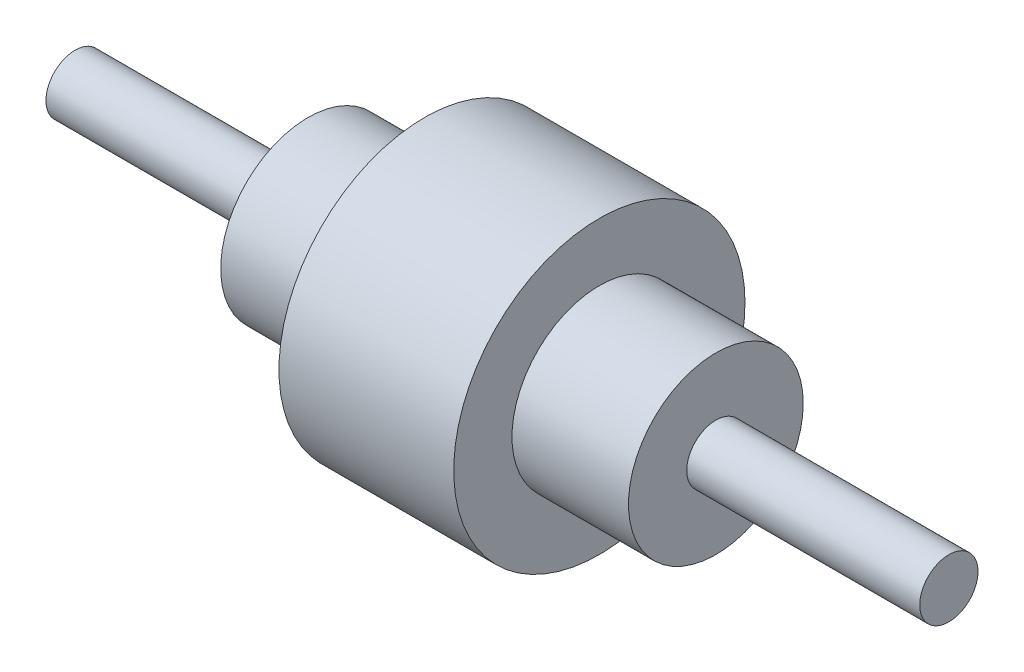
ISO-10303-21;
HEADER;
FILE_DESCRIPTION(('STEP AP214'),'2;1');
FILE_NAME('part.step','',(''),(''),'','','');
FILE_SCHEMA(('AUTOMOTIVE_DESIGN { 1 0 10303 214 1 1 1 1 }'));
ENDSEC;
DATA;
#1=APPLICATION_CONTEXT('core data for automotive mechanical design processes');
#2=APPLICATION_PROTOCOL_DEFINITION('international standard','automotive_design',2000,#1);
#3=PRODUCT_CONTEXT('',#1,'mechanical');
#4=PRODUCT('Part','Part','',(#3));
#5=PRODUCT_RELATED_PRODUCT_CATEGORY('part','',(#4));
#6=PRODUCT_DEFINITION_FORMATION('','',#4);
#7=PRODUCT_DEFINITION_CONTEXT('part definition',#1,'design');
#8=PRODUCT_DEFINITION('design','',#6,#7);
#9=PRODUCT_DEFINITION_SHAPE('','',#8);
#10=(LENGTH_UNIT() NAMED_UNIT(*) SI_UNIT(.MILLI.,.METRE.));
#11=(NAMED_UNIT(*) PLANE_ANGLE_UNIT() SI_UNIT($,.RADIAN.));
#12=(NAMED_UNIT(*) SI_UNIT($,.STERADIAN.) SOLID_ANGLE_UNIT());
#13=UNCERTAINTY_MEASURE_WITH_UNIT(LENGTH_MEASURE(1.E-05),#10,'distance_accuracy_value','');
#14=(GEOMETRIC_REPRESENTATION_CONTEXT(3) GLOBAL_UNCERTAINTY_ASSIGNED_CONTEXT((#13)) GLOBAL_UNIT_ASSIGNED_CONTEXT((#10,
#11,#12)) REPRESENTATION_CONTEXT('',''));
#15=CARTESIAN_POINT('',(0.,0.,0.));
#16=DIRECTION('',(0.,0.,1.));
#17=DIRECTION('',(1.,0.,0.));
#18=AXIS2_PLACEMENT_3D('',#15,#16,#17);
#19=CARTESIAN_POINT('',(105.011364726982,0.,50.));
#20=DIRECTION('',(-1.,0.,0.));
#21=DIRECTION('',(0.,0.,1.));
#22=AXIS2_PLACEMENT_3D('',#19,#20,#21);
#23=PLANE('',#22);
#24=CARTESIAN_POINT('',(105.011364726982,0.,0.));
#25=DIRECTION('',(1.,0.,0.));
#26=DIRECTION('',(0.,0.,-1.));
#27=AXIS2_PLACEMENT_3D('',#24,#25,#26);
#28=CIRCLE('',#27,30.);
#29=CARTESIAN_POINT('',(105.011364726982,0.,-30.));
#30=VERTEX_POINT('',#29);
#31=EDGE_CURVE('E65',#30,#30,#28,.T.);
#32=ORIENTED_EDGE('',*,*,#31,.F.);
#33=EDGE_LOOP('',(#32));
#34=FACE_BOUND('',#33,.T.);
#35=CARTESIAN_POINT('',(105.011364726982,0.,0.));
#36=DIRECTION('',(1.,0.,0.));
#37=DIRECTION('',(0.,0.,-1.));
#38=AXIS2_PLACEMENT_3D('',#35,#36,#37);
#39=CIRCLE('',#38,50.);
#40=CARTESIAN_POINT('',(105.011364726982,0.,-50.));
#41=VERTEX_POINT('',#40);
#42=EDGE_CURVE('E10',#41,#41,#39,.T.);
#43=ORIENTED_EDGE('',*,*,#42,.T.);
#44=EDGE_LOOP('',(#43));
#45=FACE_BOUND('',#44,.T.);
#46=ADVANCED_FACE('F31',(#34,#45),#23,.F.);
#47=CARTESIAN_POINT('',(0.,0.,0.));
#48=DIRECTION('',(1.,0.,0.));
#49=DIRECTION('',(0.,0.,-1.));
#50=AXIS2_PLACEMENT_3D('',#47,#48,#49);
#51=CYLINDRICAL_SURFACE('',#50,50.);
#52=ORIENTED_EDGE('',*,*,#42,.F.);
#53=EDGE_LOOP('',(#52));
#54=FACE_BOUND('',#53,.T.);
#55=CARTESIAN_POINT('',(45.0113647269819,0.,0.));
#56=DIRECTION('',(1.,0.,0.));
#57=DIRECTION('',(0.,0.,-1.));
#58=AXIS2_PLACEMENT_3D('',#55,#56,#57);
#59=CIRCLE('',#58,50.);
#60=CARTESIAN_POINT('',(45.0113647269819,0.,-50.));
#61=VERTEX_POINT('',#60);
#62=EDGE_CURVE('E37',#61,#61,#59,.T.);
#63=ORIENTED_EDGE('',*,*,#62,.T.);
#64=EDGE_LOOP('',(#63));
#65=FACE_BOUND('',#64,.T.);
#66=ADVANCED_FACE('F72',(#54,#65),#51,.T.);
#67=CARTESIAN_POINT('',(45.0113647269819,0.,30.));
#68=DIRECTION('',(1.,0.,0.));
#69=DIRECTION('',(0.,0.,-1.));
#70=AXIS2_PLACEMENT_3D('',#67,#68,#69);
#71=PLANE('',#70);
#72=ORIENTED_EDGE('',*,*,#62,.F.);
#73=EDGE_LOOP('',(#72));
#74=FACE_BOUND('',#73,.T.);
#75=CARTESIAN_POINT('',(45.0113647269819,0.,0.));
#76=DIRECTION('',(1.,0.,0.));
#77=DIRECTION('',(0.,0.,-1.));
#78=AXIS2_PLACEMENT_3D('',#75,#76,#77);
#79=CIRCLE('',#78,30.);
#80=CARTESIAN_POINT('',(45.0113647269819,0.,-30.));
#81=VERTEX_POINT('',#80);
#82=EDGE_CURVE('E41',#81,#81,#79,.T.);
#83=ORIENTED_EDGE('',*,*,#82,.T.);
#84=EDGE_LOOP('',(#83));
#85=FACE_BOUND('',#84,.T.);
#86=ADVANCED_FACE('F76',(#74,#85),#71,.F.);
#87=CARTESIAN_POINT('',(0.,0.,0.));
#88=DIRECTION('',(1.,0.,0.));
#89=DIRECTION('',(0.,0.,-1.));
#90=AXIS2_PLACEMENT_3D('',#87,#88,#89);
#91=CYLINDRICAL_SURFACE('',#90,30.);
#92=ORIENTED_EDGE('',*,*,#82,.F.);
#93=EDGE_LOOP('',(#92));
#94=FACE_BOUND('',#93,.T.);
#95=CARTESIAN_POINT('',(5.0113647269819,0.,0.));
#96=DIRECTION('',(1.,0.,0.));
#97=DIRECTION('',(0.,0.,-1.));
#98=AXIS2_PLACEMENT_3D('',#95,#96,#97);
#99=CIRCLE('',#98,30.);
#100=CARTESIAN_POINT('',(5.0113647269819,0.,-30.));
#101=VERTEX_POINT('',#100);
#102=EDGE_CURVE('E45',#101,#101,#99,.T.);
#103=ORIENTED_EDGE('',*,*,#102,.T.);
#104=EDGE_LOOP('',(#103));
#105=FACE_BOUND('',#104,.T.);
#106=ADVANCED_FACE('F81',(#94,#105),#91,.T.);
#107=CARTESIAN_POINT('',(5.0113647269819,0.,30.));
#108=DIRECTION('',(1.,0.,0.));
#109=DIRECTION('',(0.,0.,-1.));
#110=AXIS2_PLACEMENT_3D('',#107,#108,#109);
#111=PLANE('',#110);
#112=ORIENTED_EDGE('',*,*,#102,.F.);
#113=EDGE_LOOP('',(#112));
#114=FACE_BOUND('',#113,.T.);
#115=CARTESIAN_POINT('',(5.0113647269819,0.,0.));
#116=DIRECTION('',(1.,0.,0.));
#117=DIRECTION('',(0.,0.,-1.));
#118=AXIS2_PLACEMENT_3D('',#115,#116,#117);
#119=CIRCLE('',#118,10.);
#120=CARTESIAN_POINT('',(5.0113647269819,0.,-10.));
#121=VERTEX_POINT('',#120);
#122=EDGE_CURVE('E50',#121,#121,#119,.T.);
#123=ORIENTED_EDGE('',*,*,#122,.T.);
#124=EDGE_LOOP('',(#123));
#125=FACE_BOUND('',#124,.T.);
#126=ADVANCED_FACE('F87',(#114,#125),#111,.F.);
#127=CARTESIAN_POINT('',(0.,0.,0.));
#128=DIRECTION('',(1.,0.,0.));
#129=DIRECTION('',(0.,0.,-1.));
#130=AXIS2_PLACEMENT_3D('',#127,#128,#129);
#131=CYLINDRICAL_SURFACE('',#130,10.);
#132=ORIENTED_EDGE('',*,*,#122,.F.);
#133=EDGE_LOOP('',(#132));
#134=FACE_BOUND('',#133,.T.);
#135=CARTESIAN_POINT('',(-74.9886352730181,0.,0.));
#136=DIRECTION('',(1.,0.,0.));
#137=DIRECTION('',(0.,0.,-1.));
#138=AXIS2_PLACEMENT_3D('',#135,#136,#137);
#139=CIRCLE('',#138,10.);
#140=CARTESIAN_POINT('',(-74.9886352730181,0.,-10.));
#141=VERTEX_POINT('',#140);
#142=EDGE_CURVE('E53',#141,#141,#139,.T.);
#143=ORIENTED_EDGE('',*,*,#142,.T.);
#144=EDGE_LOOP('',(#143));
#145=FACE_BOUND('',#144,.T.);
#146=ADVANCED_FACE('F91',(#134,#145),#131,.T.);
#147=CARTESIAN_POINT('',(-74.9886352730181,0.,10.));
#148=DIRECTION('',(1.,0.,0.));
#149=DIRECTION('',(0.,0.,-1.));
#150=AXIS2_PLACEMENT_3D('',#147,#148,#149);
#151=PLANE('',#150);
#152=ORIENTED_EDGE('',*,*,#142,.F.);
#153=EDGE_LOOP('',(#152));
#154=FACE_BOUND('',#153,.T.);
#155=ADVANCED_FACE('F95',(#154),#151,.F.);
#156=CARTESIAN_POINT('',(225.011364726982,0.,10.));
#157=DIRECTION('',(-1.,0.,0.));
#158=DIRECTION('',(0.,0.,1.));
#159=AXIS2_PLACEMENT_3D('',#156,#157,#158);
#160=PLANE('',#159);
#161=CARTESIAN_POINT('',(225.011364726982,0.,0.));
#162=DIRECTION('',(1.,0.,0.));
#163=DIRECTION('',(0.,0.,-1.));
#164=AXIS2_PLACEMENT_3D('',#161,#162,#163);
#165=CIRCLE('',#164,10.);
#166=CARTESIAN_POINT('',(225.011364726982,0.,-10.));
#167=VERTEX_POINT('',#166);
#168=EDGE_CURVE('E56',#167,#167,#165,.T.);
#169=ORIENTED_EDGE('',*,*,#168,.T.);
#170=EDGE_LOOP('',(#169));
#171=FACE_BOUND('',#170,.T.);
#172=ADVANCED_FACE('F99',(#171),#160,.F.);
#173=CARTESIAN_POINT('',(0.,0.,0.));
#174=DIRECTION('',(1.,0.,0.));
#175=DIRECTION('',(0.,0.,-1.));
#176=AXIS2_PLACEMENT_3D('',#173,#174,#175);
#177=CYLINDRICAL_SURFACE('',#176,10.);
#178=ORIENTED_EDGE('',*,*,#168,.F.);
#179=EDGE_LOOP('',(#178));
#180=FACE_BOUND('',#179,.T.);
#181=CARTESIAN_POINT('',(145.011364726982,0.,0.));
#182=DIRECTION('',(1.,0.,0.));
#183=DIRECTION('',(0.,0.,-1.));
#184=AXIS2_PLACEMENT_3D('',#181,#182,#183);
#185=CIRCLE('',#184,10.);
#186=CARTESIAN_POINT('',(145.011364726982,0.,-10.));
#187=VERTEX_POINT('',#186);
#188=EDGE_CURVE('E59',#187,#187,#185,.T.);
#189=ORIENTED_EDGE('',*,*,#188,.T.);
#190=EDGE_LOOP('',(#189));
#191=FACE_BOUND('',#190,.T.);
#192=ADVANCED_FACE('F103',(#180,#191),#177,.T.);
#193=CARTESIAN_POINT('',(145.011364726982,0.,30.));
#194=DIRECTION('',(-1.,0.,0.));
#195=DIRECTION('',(0.,0.,1.));
#196=AXIS2_PLACEMENT_3D('',#193,#194,#195);
#197=PLANE('',#196);
#198=ORIENTED_EDGE('',*,*,#188,.F.);
#199=EDGE_LOOP('',(#198));
#200=FACE_BOUND('',#199,.T.);
#201=CARTESIAN_POINT('',(145.011364726982,0.,0.));
#202=DIRECTION('',(1.,0.,0.));
#203=DIRECTION('',(0.,0.,-1.));
#204=AXIS2_PLACEMENT_3D('',#201,#202,#203);
#205=CIRCLE('',#204,30.);
#206=CARTESIAN_POINT('',(145.011364726982,0.,-30.));
#207=VERTEX_POINT('',#206);
#208=EDGE_CURVE('E62',#207,#207,#205,.T.);
#209=ORIENTED_EDGE('',*,*,#208,.T.);
#210=EDGE_LOOP('',(#209));
#211=FACE_BOUND('',#210,.T.);
#212=ADVANCED_FACE('F107',(#200,#211),#197,.F.);
#213=CARTESIAN_POINT('',(0.,0.,0.));
#214=DIRECTION('',(1.,0.,0.));
#215=DIRECTION('',(0.,0.,-1.));
#216=AXIS2_PLACEMENT_3D('',#213,#214,#215);
#217=CYLINDRICAL_SURFACE('',#216,30.);
#218=ORIENTED_EDGE('',*,*,#208,.F.);
#219=EDGE_LOOP('',(#218));
#220=FACE_BOUND('',#219,.T.);
#221=ORIENTED_EDGE('',*,*,#31,.T.);
#222=EDGE_LOOP('',(#221));
#223=FACE_BOUND('',#222,.T.);
#224=ADVANCED_FACE('F69',(#220,#223),#217,.T.);
#225=CLOSED_SHELL('',(#46,#66,#86,#106,#126,#146,#155,#172,#192,#212,#224));
#226=MANIFOLD_SOLID_BREP('B2',#225);
#227=ADVANCED_BREP_SHAPE_REPRESENTATION('',(#18,#226),#14);
#228=SHAPE_DEFINITION_REPRESENTATION(#9,#227);
ENDSEC;
END-ISO-10303-21;
